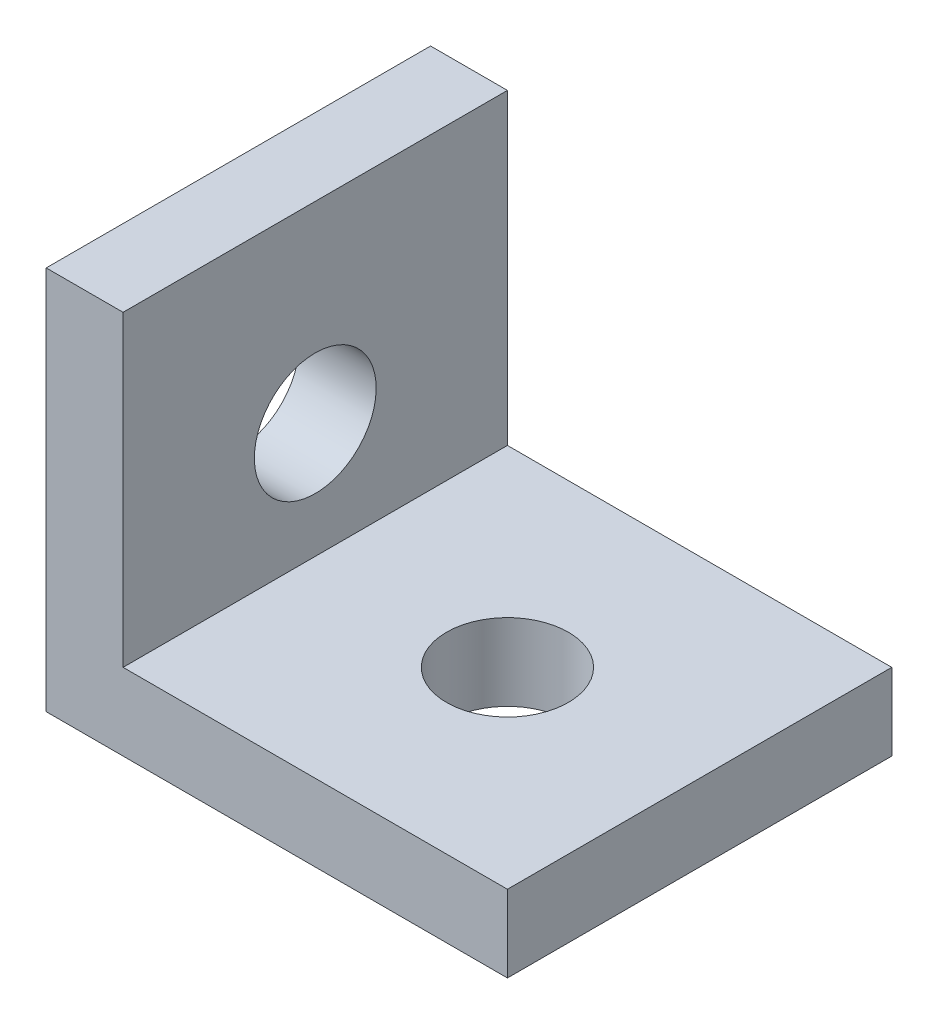
ISO-10303-21;
HEADER;
FILE_DESCRIPTION(('STEP AP214'),'2;1');
FILE_NAME('part.step','',(''),(''),'','','');
FILE_SCHEMA(('AUTOMOTIVE_DESIGN { 1 0 10303 214 1 1 1 1 }'));
ENDSEC;
DATA;
#1=APPLICATION_CONTEXT('core data for automotive mechanical design processes');
#2=APPLICATION_PROTOCOL_DEFINITION('international standard','automotive_design',2000,#1);
#3=PRODUCT_CONTEXT('',#1,'mechanical');
#4=PRODUCT('Part','Part','',(#3));
#5=PRODUCT_RELATED_PRODUCT_CATEGORY('part','',(#4));
#6=PRODUCT_DEFINITION_FORMATION('','',#4);
#7=PRODUCT_DEFINITION_CONTEXT('part definition',#1,'design');
#8=PRODUCT_DEFINITION('design','',#6,#7);
#9=PRODUCT_DEFINITION_SHAPE('','',#8);
#10=(LENGTH_UNIT() NAMED_UNIT(*) SI_UNIT(.MILLI.,.METRE.));
#11=(NAMED_UNIT(*) PLANE_ANGLE_UNIT() SI_UNIT($,.RADIAN.));
#12=(NAMED_UNIT(*) SI_UNIT($,.STERADIAN.) SOLID_ANGLE_UNIT());
#13=UNCERTAINTY_MEASURE_WITH_UNIT(LENGTH_MEASURE(1.E-05),#10,'distance_accuracy_value','');
#14=(GEOMETRIC_REPRESENTATION_CONTEXT(3) GLOBAL_UNCERTAINTY_ASSIGNED_CONTEXT((#13)) GLOBAL_UNIT_ASSIGNED_CONTEXT((#10,
#11,#12)) REPRESENTATION_CONTEXT('',''));
#15=CARTESIAN_POINT('',(0.,0.,0.));
#16=DIRECTION('',(0.,0.,1.));
#17=DIRECTION('',(1.,0.,0.));
#18=AXIS2_PLACEMENT_3D('',#15,#16,#17);
#19=CARTESIAN_POINT('',(0.,0.,10.));
#20=DIRECTION('',(1.,0.,0.));
#21=DIRECTION('',(0.,0.,-1.));
#22=AXIS2_PLACEMENT_3D('',#19,#20,#21);
#23=PLANE('',#22);
#24=CARTESIAN_POINT('',(0.,5.,5.));
#25=DIRECTION('',(1.,0.,0.));
#26=DIRECTION('',(0.,1.,0.));
#27=AXIS2_PLACEMENT_3D('',#24,#25,#26);
#28=CIRCLE('',#27,1.585);
#29=CARTESIAN_POINT('',(0.,6.585,5.));
#30=VERTEX_POINT('',#29);
#31=EDGE_CURVE('E159',#30,#30,#28,.T.);
#32=ORIENTED_EDGE('',*,*,#31,.T.);
#33=EDGE_LOOP('',(#32));
#34=FACE_BOUND('',#33,.T.);
#35=DIRECTION('',(0.,-1.,0.));
#36=VECTOR('',#35,1.);
#37=CARTESIAN_POINT('',(0.,0.,0.));
#38=LINE('',#37,#36);
#39=CARTESIAN_POINT('',(0.,10.,0.));
#40=VERTEX_POINT('',#39);
#41=CARTESIAN_POINT('',(0.,0.,0.));
#42=VERTEX_POINT('',#41);
#43=EDGE_CURVE('E115',#40,#42,#38,.T.);
#44=ORIENTED_EDGE('',*,*,#43,.T.);
#45=DIRECTION('',(0.,0.,-1.));
#46=VECTOR('',#45,1.);
#47=CARTESIAN_POINT('',(0.,0.,10.));
#48=LINE('',#47,#46);
#49=CARTESIAN_POINT('',(0.,0.,10.));
#50=VERTEX_POINT('',#49);
#51=EDGE_CURVE('E11',#50,#42,#48,.T.);
#52=ORIENTED_EDGE('',*,*,#51,.F.);
#53=DIRECTION('',(0.,-1.,0.));
#54=VECTOR('',#53,1.);
#55=CARTESIAN_POINT('',(0.,0.,10.));
#56=LINE('',#55,#54);
#57=CARTESIAN_POINT('',(0.,10.,10.));
#58=VERTEX_POINT('',#57);
#59=EDGE_CURVE('E126',#58,#50,#56,.T.);
#60=ORIENTED_EDGE('',*,*,#59,.F.);
#61=DIRECTION('',(0.,0.,-1.));
#62=VECTOR('',#61,1.);
#63=CARTESIAN_POINT('',(0.,10.,10.));
#64=LINE('',#63,#62);
#65=EDGE_CURVE('E111',#58,#40,#64,.T.);
#66=ORIENTED_EDGE('',*,*,#65,.T.);
#67=EDGE_LOOP('',(#44,#52,#60,#66));
#68=FACE_BOUND('',#67,.T.);
#69=ADVANCED_FACE('F31',(#34,#68),#23,.F.);
#70=CARTESIAN_POINT('',(0.,0.,10.));
#71=DIRECTION('',(0.,1.,0.));
#72=DIRECTION('',(0.,0.,1.));
#73=AXIS2_PLACEMENT_3D('',#70,#71,#72);
#74=PLANE('',#73);
#75=CARTESIAN_POINT('',(7.,0.,5.));
#76=DIRECTION('',(0.,1.,0.));
#77=DIRECTION('',(-1.,0.,0.));
#78=AXIS2_PLACEMENT_3D('',#75,#76,#77);
#79=CIRCLE('',#78,1.585);
#80=CARTESIAN_POINT('',(5.415,0.,5.));
#81=VERTEX_POINT('',#80);
#82=EDGE_CURVE('E119',#81,#81,#79,.T.);
#83=ORIENTED_EDGE('',*,*,#82,.T.);
#84=EDGE_LOOP('',(#83));
#85=FACE_BOUND('',#84,.T.);
#86=DIRECTION('',(1.,0.,0.));
#87=VECTOR('',#86,1.);
#88=CARTESIAN_POINT('',(0.,0.,0.));
#89=LINE('',#88,#87);
#90=CARTESIAN_POINT('',(12.,0.,0.));
#91=VERTEX_POINT('',#90);
#92=EDGE_CURVE('E118',#42,#91,#89,.T.);
#93=ORIENTED_EDGE('',*,*,#92,.T.);
#94=DIRECTION('',(0.,0.,-1.));
#95=VECTOR('',#94,1.);
#96=CARTESIAN_POINT('',(12.,0.,10.));
#97=LINE('',#96,#95);
#98=CARTESIAN_POINT('',(12.,0.,10.));
#99=VERTEX_POINT('',#98);
#100=EDGE_CURVE('E39',#99,#91,#97,.T.);
#101=ORIENTED_EDGE('',*,*,#100,.F.);
#102=DIRECTION('',(1.,0.,0.));
#103=VECTOR('',#102,1.);
#104=CARTESIAN_POINT('',(0.,0.,10.));
#105=LINE('',#104,#103);
#106=EDGE_CURVE('E84',#50,#99,#105,.T.);
#107=ORIENTED_EDGE('',*,*,#106,.F.);
#108=ORIENTED_EDGE('',*,*,#51,.T.);
#109=EDGE_LOOP('',(#93,#101,#107,#108));
#110=FACE_BOUND('',#109,.T.);
#111=ADVANCED_FACE('F151',(#85,#110),#74,.F.);
#112=CARTESIAN_POINT('',(12.,0.,10.));
#113=DIRECTION('',(-1.,0.,0.));
#114=DIRECTION('',(0.,0.,1.));
#115=AXIS2_PLACEMENT_3D('',#112,#113,#114);
#116=PLANE('',#115);
#117=DIRECTION('',(0.,1.,0.));
#118=VECTOR('',#117,1.);
#119=CARTESIAN_POINT('',(12.,0.,0.));
#120=LINE('',#119,#118);
#121=CARTESIAN_POINT('',(12.,2.,0.));
#122=VERTEX_POINT('',#121);
#123=EDGE_CURVE('E121',#91,#122,#120,.T.);
#124=ORIENTED_EDGE('',*,*,#123,.T.);
#125=DIRECTION('',(0.,0.,-1.));
#126=VECTOR('',#125,1.);
#127=CARTESIAN_POINT('',(12.,2.,10.));
#128=LINE('',#127,#126);
#129=CARTESIAN_POINT('',(12.,2.,10.));
#130=VERTEX_POINT('',#129);
#131=EDGE_CURVE('E106',#130,#122,#128,.T.);
#132=ORIENTED_EDGE('',*,*,#131,.F.);
#133=DIRECTION('',(0.,1.,0.));
#134=VECTOR('',#133,1.);
#135=CARTESIAN_POINT('',(12.,0.,10.));
#136=LINE('',#135,#134);
#137=EDGE_CURVE('E97',#99,#130,#136,.T.);
#138=ORIENTED_EDGE('',*,*,#137,.F.);
#139=ORIENTED_EDGE('',*,*,#100,.T.);
#140=EDGE_LOOP('',(#124,#132,#138,#139));
#141=FACE_BOUND('',#140,.T.);
#142=ADVANCED_FACE('F132',(#141),#116,.F.);
#143=CARTESIAN_POINT('',(12.,2.,10.));
#144=DIRECTION('',(0.,-1.,0.));
#145=DIRECTION('',(1.,0.,0.));
#146=AXIS2_PLACEMENT_3D('',#143,#144,#145);
#147=PLANE('',#146);
#148=CARTESIAN_POINT('',(7.,2.,5.));
#149=DIRECTION('',(0.,1.,0.));
#150=DIRECTION('',(-1.,0.,0.));
#151=AXIS2_PLACEMENT_3D('',#148,#149,#150);
#152=CIRCLE('',#151,1.585);
#153=CARTESIAN_POINT('',(5.415,2.,5.));
#154=VERTEX_POINT('',#153);
#155=EDGE_CURVE('E161',#154,#154,#152,.T.);
#156=ORIENTED_EDGE('',*,*,#155,.F.);
#157=EDGE_LOOP('',(#156));
#158=FACE_BOUND('',#157,.T.);
#159=DIRECTION('',(-1.,0.,0.));
#160=VECTOR('',#159,1.);
#161=CARTESIAN_POINT('',(12.,2.,0.));
#162=LINE('',#161,#160);
#163=CARTESIAN_POINT('',(2.,2.,0.));
#164=VERTEX_POINT('',#163);
#165=EDGE_CURVE('E105',#122,#164,#162,.T.);
#166=ORIENTED_EDGE('',*,*,#165,.T.);
#167=DIRECTION('',(0.,0.,-1.));
#168=VECTOR('',#167,1.);
#169=CARTESIAN_POINT('',(2.,2.,10.));
#170=LINE('',#169,#168);
#171=CARTESIAN_POINT('',(2.,2.,10.));
#172=VERTEX_POINT('',#171);
#173=EDGE_CURVE('E102',#172,#164,#170,.T.);
#174=ORIENTED_EDGE('',*,*,#173,.F.);
#175=DIRECTION('',(-1.,0.,0.));
#176=VECTOR('',#175,1.);
#177=CARTESIAN_POINT('',(12.,2.,10.));
#178=LINE('',#177,#176);
#179=EDGE_CURVE('E91',#130,#172,#178,.T.);
#180=ORIENTED_EDGE('',*,*,#179,.F.);
#181=ORIENTED_EDGE('',*,*,#131,.T.);
#182=EDGE_LOOP('',(#166,#174,#180,#181));
#183=FACE_BOUND('',#182,.T.);
#184=ADVANCED_FACE('F103',(#158,#183),#147,.F.);
#185=CARTESIAN_POINT('',(2.,10.,10.));
#186=DIRECTION('',(-1.,0.,0.));
#187=DIRECTION('',(0.,-1.,0.));
#188=AXIS2_PLACEMENT_3D('',#185,#186,#187);
#189=PLANE('',#188);
#190=CARTESIAN_POINT('',(2.,5.,5.));
#191=DIRECTION('',(1.,0.,0.));
#192=DIRECTION('',(0.,1.,0.));
#193=AXIS2_PLACEMENT_3D('',#190,#191,#192);
#194=CIRCLE('',#193,1.585);
#195=CARTESIAN_POINT('',(2.,6.585,5.));
#196=VERTEX_POINT('',#195);
#197=EDGE_CURVE('E162',#196,#196,#194,.T.);
#198=ORIENTED_EDGE('',*,*,#197,.F.);
#199=EDGE_LOOP('',(#198));
#200=FACE_BOUND('',#199,.T.);
#201=DIRECTION('',(0.,1.,0.));
#202=VECTOR('',#201,1.);
#203=CARTESIAN_POINT('',(2.,10.,0.));
#204=LINE('',#203,#202);
#205=CARTESIAN_POINT('',(2.,10.,0.));
#206=VERTEX_POINT('',#205);
#207=EDGE_CURVE('E70',#164,#206,#204,.T.);
#208=ORIENTED_EDGE('',*,*,#207,.T.);
#209=DIRECTION('',(0.,0.,-1.));
#210=VECTOR('',#209,1.);
#211=CARTESIAN_POINT('',(2.,10.,10.));
#212=LINE('',#211,#210);
#213=CARTESIAN_POINT('',(2.,10.,10.));
#214=VERTEX_POINT('',#213);
#215=EDGE_CURVE('E107',#214,#206,#212,.T.);
#216=ORIENTED_EDGE('',*,*,#215,.F.);
#217=DIRECTION('',(0.,1.,0.));
#218=VECTOR('',#217,1.);
#219=CARTESIAN_POINT('',(2.,10.,10.));
#220=LINE('',#219,#218);
#221=EDGE_CURVE('E95',#172,#214,#220,.T.);
#222=ORIENTED_EDGE('',*,*,#221,.F.);
#223=ORIENTED_EDGE('',*,*,#173,.T.);
#224=EDGE_LOOP('',(#208,#216,#222,#223));
#225=FACE_BOUND('',#224,.T.);
#226=ADVANCED_FACE('F109',(#200,#225),#189,.F.);
#227=CARTESIAN_POINT('',(0.,10.,10.));
#228=DIRECTION('',(0.,-1.,0.));
#229=DIRECTION('',(0.,0.,-1.));
#230=AXIS2_PLACEMENT_3D('',#227,#228,#229);
#231=PLANE('',#230);
#232=DIRECTION('',(-1.,0.,0.));
#233=VECTOR('',#232,1.);
#234=CARTESIAN_POINT('',(0.,10.,0.));
#235=LINE('',#234,#233);
#236=EDGE_CURVE('E76',#206,#40,#235,.T.);
#237=ORIENTED_EDGE('',*,*,#236,.T.);
#238=ORIENTED_EDGE('',*,*,#65,.F.);
#239=DIRECTION('',(-1.,0.,0.));
#240=VECTOR('',#239,1.);
#241=CARTESIAN_POINT('',(0.,10.,10.));
#242=LINE('',#241,#240);
#243=EDGE_CURVE('E47',#214,#58,#242,.T.);
#244=ORIENTED_EDGE('',*,*,#243,.F.);
#245=ORIENTED_EDGE('',*,*,#215,.T.);
#246=EDGE_LOOP('',(#237,#238,#244,#245));
#247=FACE_BOUND('',#246,.T.);
#248=ADVANCED_FACE('F139',(#247),#231,.F.);
#249=CARTESIAN_POINT('',(0.,10.,10.));
#250=DIRECTION('',(0.,0.,-1.));
#251=DIRECTION('',(-1.,0.,0.));
#252=AXIS2_PLACEMENT_3D('',#249,#250,#251);
#253=PLANE('',#252);
#254=ORIENTED_EDGE('',*,*,#59,.T.);
#255=ORIENTED_EDGE('',*,*,#106,.T.);
#256=ORIENTED_EDGE('',*,*,#137,.T.);
#257=ORIENTED_EDGE('',*,*,#179,.T.);
#258=ORIENTED_EDGE('',*,*,#221,.T.);
#259=ORIENTED_EDGE('',*,*,#243,.T.);
#260=EDGE_LOOP('',(#254,#255,#256,#257,#258,#259));
#261=FACE_BOUND('',#260,.T.);
#262=ADVANCED_FACE('F93',(#261),#253,.F.);
#263=CARTESIAN_POINT('',(0.,10.,0.));
#264=DIRECTION('',(0.,0.,-1.));
#265=DIRECTION('',(-1.,0.,0.));
#266=AXIS2_PLACEMENT_3D('',#263,#264,#265);
#267=PLANE('',#266);
#268=ORIENTED_EDGE('',*,*,#43,.F.);
#269=ORIENTED_EDGE('',*,*,#236,.F.);
#270=ORIENTED_EDGE('',*,*,#207,.F.);
#271=ORIENTED_EDGE('',*,*,#165,.F.);
#272=ORIENTED_EDGE('',*,*,#123,.F.);
#273=ORIENTED_EDGE('',*,*,#92,.F.);
#274=EDGE_LOOP('',(#268,#269,#270,#271,#272,#273));
#275=FACE_BOUND('',#274,.T.);
#276=ADVANCED_FACE('F135',(#275),#267,.T.);
#277=CARTESIAN_POINT('',(7.,0.,5.));
#278=DIRECTION('',(0.,1.,0.));
#279=DIRECTION('',(-1.,0.,0.));
#280=AXIS2_PLACEMENT_3D('',#277,#278,#279);
#281=CYLINDRICAL_SURFACE('',#280,1.585);
#282=ORIENTED_EDGE('',*,*,#82,.F.);
#283=EDGE_LOOP('',(#282));
#284=FACE_BOUND('',#283,.T.);
#285=ORIENTED_EDGE('',*,*,#155,.T.);
#286=EDGE_LOOP('',(#285));
#287=FACE_BOUND('',#286,.T.);
#288=ADVANCED_FACE('F174',(#284,#287),#281,.F.);
#289=CARTESIAN_POINT('',(0.,5.,5.));
#290=DIRECTION('',(1.,0.,0.));
#291=DIRECTION('',(0.,1.,0.));
#292=AXIS2_PLACEMENT_3D('',#289,#290,#291);
#293=CYLINDRICAL_SURFACE('',#292,1.585);
#294=ORIENTED_EDGE('',*,*,#31,.F.);
#295=EDGE_LOOP('',(#294));
#296=FACE_BOUND('',#295,.T.);
#297=ORIENTED_EDGE('',*,*,#197,.T.);
#298=EDGE_LOOP('',(#297));
#299=FACE_BOUND('',#298,.T.);
#300=ADVANCED_FACE('F177',(#296,#299),#293,.F.);
#301=CLOSED_SHELL('',(#69,#111,#142,#184,#226,#248,#262,#276,#288,#300));
#302=MANIFOLD_SOLID_BREP('B2',#301);
#303=ADVANCED_BREP_SHAPE_REPRESENTATION('',(#18,#302),#14);
#304=SHAPE_DEFINITION_REPRESENTATION(#9,#303);
ENDSEC;
END-ISO-10303-21;
